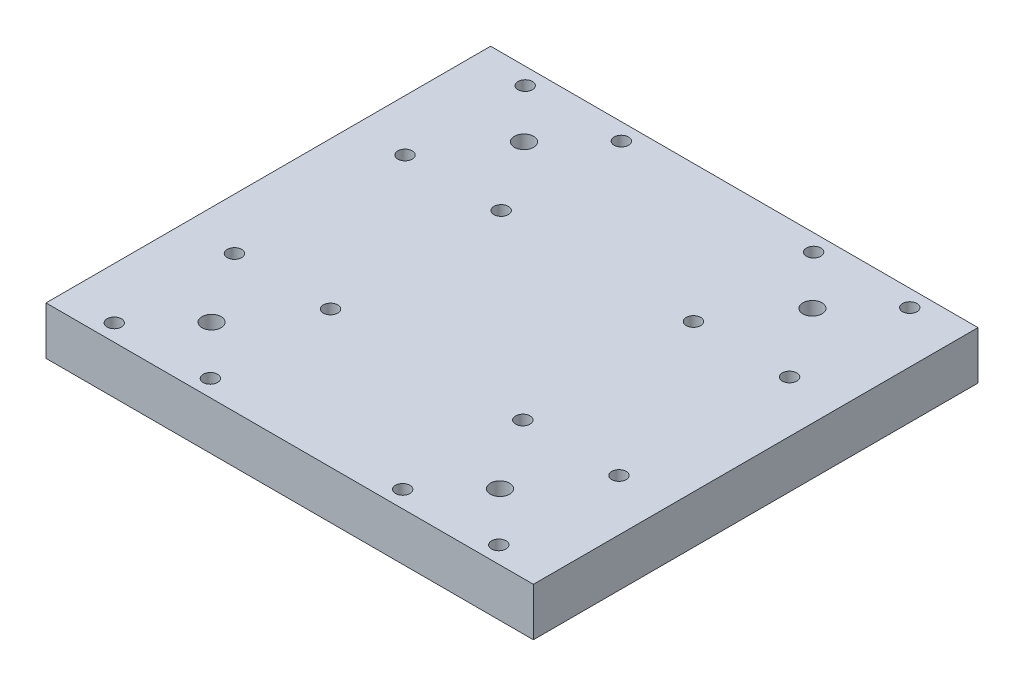
ISO-10303-21;
HEADER;
FILE_DESCRIPTION(('STEP AP214'),'2;1');
FILE_NAME('part.step','',(''),(''),'','','');
FILE_SCHEMA(('AUTOMOTIVE_DESIGN { 1 0 10303 214 1 1 1 1 }'));
ENDSEC;
DATA;
#1=APPLICATION_CONTEXT('core data for automotive mechanical design processes');
#2=APPLICATION_PROTOCOL_DEFINITION('international standard','automotive_design',2000,#1);
#3=PRODUCT_CONTEXT('',#1,'mechanical');
#4=PRODUCT('Part','Part','',(#3));
#5=PRODUCT_RELATED_PRODUCT_CATEGORY('part','',(#4));
#6=PRODUCT_DEFINITION_FORMATION('','',#4);
#7=PRODUCT_DEFINITION_CONTEXT('part definition',#1,'design');
#8=PRODUCT_DEFINITION('design','',#6,#7);
#9=PRODUCT_DEFINITION_SHAPE('','',#8);
#10=(LENGTH_UNIT() NAMED_UNIT(*) SI_UNIT(.MILLI.,.METRE.));
#11=(NAMED_UNIT(*) PLANE_ANGLE_UNIT() SI_UNIT($,.RADIAN.));
#12=(NAMED_UNIT(*) SI_UNIT($,.STERADIAN.) SOLID_ANGLE_UNIT());
#13=UNCERTAINTY_MEASURE_WITH_UNIT(LENGTH_MEASURE(1.E-05),#10,'distance_accuracy_value','');
#14=(GEOMETRIC_REPRESENTATION_CONTEXT(3) GLOBAL_UNCERTAINTY_ASSIGNED_CONTEXT((#13)) GLOBAL_UNIT_ASSIGNED_CONTEXT((#10,
#11,#12)) REPRESENTATION_CONTEXT('',''));
#15=CARTESIAN_POINT('',(0.,0.,0.));
#16=DIRECTION('',(0.,0.,1.));
#17=DIRECTION('',(1.,0.,0.));
#18=AXIS2_PLACEMENT_3D('',#15,#16,#17);
#19=CARTESIAN_POINT('',(0.,10.,0.));
#20=DIRECTION('',(0.,-1.,0.));
#21=DIRECTION('',(0.,0.,-1.));
#22=AXIS2_PLACEMENT_3D('',#19,#20,#21);
#23=PLANE('',#22);
#24=DIRECTION('',(0.,0.,-1.));
#25=VECTOR('',#24,1.);
#26=CARTESIAN_POINT('',(50.7,10.,46.25));
#27=LINE('',#26,#25);
#28=CARTESIAN_POINT('',(50.7,10.,46.25));
#29=VERTEX_POINT('',#28);
#30=CARTESIAN_POINT('',(50.7,10.,-46.25));
#31=VERTEX_POINT('',#30);
#32=EDGE_CURVE('E85',#29,#31,#27,.T.);
#33=ORIENTED_EDGE('',*,*,#32,.T.);
#34=DIRECTION('',(-1.,0.,0.));
#35=VECTOR('',#34,1.);
#36=CARTESIAN_POINT('',(-50.7,10.,-46.25));
#37=LINE('',#36,#35);
#38=CARTESIAN_POINT('',(-50.7,10.,-46.25));
#39=VERTEX_POINT('',#38);
#40=EDGE_CURVE('E80',#31,#39,#37,.T.);
#41=ORIENTED_EDGE('',*,*,#40,.T.);
#42=DIRECTION('',(0.,0.,1.));
#43=VECTOR('',#42,1.);
#44=CARTESIAN_POINT('',(-50.7,10.,46.25));
#45=LINE('',#44,#43);
#46=CARTESIAN_POINT('',(-50.7,10.,46.25));
#47=VERTEX_POINT('',#46);
#48=EDGE_CURVE('E83',#39,#47,#45,.T.);
#49=ORIENTED_EDGE('',*,*,#48,.T.);
#50=DIRECTION('',(1.,0.,0.));
#51=VECTOR('',#50,1.);
#52=CARTESIAN_POINT('',(-50.7,10.,46.25));
#53=LINE('',#52,#51);
#54=EDGE_CURVE('E50',#47,#29,#53,.T.);
#55=ORIENTED_EDGE('',*,*,#54,.T.);
#56=EDGE_LOOP('',(#33,#41,#49,#55));
#57=FACE_BOUND('',#56,.T.);
#58=CARTESIAN_POINT('',(-40.,10.,-42.75));
#59=DIRECTION('',(0.,1.,0.));
#60=DIRECTION('',(0.,0.,1.));
#61=AXIS2_PLACEMENT_3D('',#58,#59,#60);
#62=CIRCLE('',#61,1.5);
#63=CARTESIAN_POINT('',(-40.,10.,-41.25));
#64=VERTEX_POINT('',#63);
#65=EDGE_CURVE('E100',#64,#64,#62,.T.);
#66=ORIENTED_EDGE('',*,*,#65,.F.);
#67=EDGE_LOOP('',(#66));
#68=FACE_BOUND('',#67,.T.);
#69=CARTESIAN_POINT('',(-20.,10.,-42.75));
#70=DIRECTION('',(0.,1.,0.));
#71=DIRECTION('',(0.,0.,1.));
#72=AXIS2_PLACEMENT_3D('',#69,#70,#71);
#73=CIRCLE('',#72,1.5);
#74=CARTESIAN_POINT('',(-20.,10.,-41.25));
#75=VERTEX_POINT('',#74);
#76=EDGE_CURVE('E115',#75,#75,#73,.T.);
#77=ORIENTED_EDGE('',*,*,#76,.F.);
#78=EDGE_LOOP('',(#77));
#79=FACE_BOUND('',#78,.T.);
#80=CARTESIAN_POINT('',(-20.,10.,-17.75));
#81=DIRECTION('',(0.,1.,0.));
#82=DIRECTION('',(0.,0.,1.));
#83=AXIS2_PLACEMENT_3D('',#80,#81,#82);
#84=CIRCLE('',#83,1.5);
#85=CARTESIAN_POINT('',(-20.,10.,-16.25));
#86=VERTEX_POINT('',#85);
#87=EDGE_CURVE('E121',#86,#86,#84,.T.);
#88=ORIENTED_EDGE('',*,*,#87,.F.);
#89=EDGE_LOOP('',(#88));
#90=FACE_BOUND('',#89,.T.);
#91=CARTESIAN_POINT('',(-40.,10.,-17.75));
#92=DIRECTION('',(0.,1.,0.));
#93=DIRECTION('',(0.,0.,1.));
#94=AXIS2_PLACEMENT_3D('',#91,#92,#93);
#95=CIRCLE('',#94,1.5);
#96=CARTESIAN_POINT('',(-40.,10.,-16.25));
#97=VERTEX_POINT('',#96);
#98=EDGE_CURVE('E127',#97,#97,#95,.T.);
#99=ORIENTED_EDGE('',*,*,#98,.F.);
#100=EDGE_LOOP('',(#99));
#101=FACE_BOUND('',#100,.T.);
#102=CARTESIAN_POINT('',(-40.,10.,42.75));
#103=DIRECTION('',(0.,1.,0.));
#104=DIRECTION('',(0.,0.,-1.));
#105=AXIS2_PLACEMENT_3D('',#102,#103,#104);
#106=CIRCLE('',#105,1.5);
#107=CARTESIAN_POINT('',(-40.,10.,41.25));
#108=VERTEX_POINT('',#107);
#109=EDGE_CURVE('E133',#108,#108,#106,.T.);
#110=ORIENTED_EDGE('',*,*,#109,.F.);
#111=EDGE_LOOP('',(#110));
#112=FACE_BOUND('',#111,.T.);
#113=CARTESIAN_POINT('',(-20.,10.,42.75));
#114=DIRECTION('',(0.,1.,0.));
#115=DIRECTION('',(0.,0.,-1.));
#116=AXIS2_PLACEMENT_3D('',#113,#114,#115);
#117=CIRCLE('',#116,1.5);
#118=CARTESIAN_POINT('',(-20.,10.,41.25));
#119=VERTEX_POINT('',#118);
#120=EDGE_CURVE('E139',#119,#119,#117,.T.);
#121=ORIENTED_EDGE('',*,*,#120,.F.);
#122=EDGE_LOOP('',(#121));
#123=FACE_BOUND('',#122,.T.);
#124=CARTESIAN_POINT('',(-20.,10.,17.75));
#125=DIRECTION('',(0.,1.,0.));
#126=DIRECTION('',(0.,0.,-1.));
#127=AXIS2_PLACEMENT_3D('',#124,#125,#126);
#128=CIRCLE('',#127,1.5);
#129=CARTESIAN_POINT('',(-20.,10.,16.25));
#130=VERTEX_POINT('',#129);
#131=EDGE_CURVE('E145',#130,#130,#128,.T.);
#132=ORIENTED_EDGE('',*,*,#131,.F.);
#133=EDGE_LOOP('',(#132));
#134=FACE_BOUND('',#133,.T.);
#135=CARTESIAN_POINT('',(30.,10.,-32.5));
#136=DIRECTION('',(0.,1.,0.));
#137=DIRECTION('',(0.,0.,-1.));
#138=AXIS2_PLACEMENT_3D('',#135,#136,#137);
#139=CIRCLE('',#138,2.);
#140=CARTESIAN_POINT('',(30.,10.,-34.5));
#141=VERTEX_POINT('',#140);
#142=EDGE_CURVE('E151',#141,#141,#139,.T.);
#143=ORIENTED_EDGE('',*,*,#142,.F.);
#144=EDGE_LOOP('',(#143));
#145=FACE_BOUND('',#144,.T.);
#146=CARTESIAN_POINT('',(-40.,10.,17.75));
#147=DIRECTION('',(0.,1.,0.));
#148=DIRECTION('',(0.,0.,-1.));
#149=AXIS2_PLACEMENT_3D('',#146,#147,#148);
#150=CIRCLE('',#149,1.5);
#151=CARTESIAN_POINT('',(-40.,10.,16.25));
#152=VERTEX_POINT('',#151);
#153=EDGE_CURVE('E157',#152,#152,#150,.T.);
#154=ORIENTED_EDGE('',*,*,#153,.F.);
#155=EDGE_LOOP('',(#154));
#156=FACE_BOUND('',#155,.T.);
#157=CARTESIAN_POINT('',(40.,10.,17.75));
#158=DIRECTION('',(0.,1.,0.));
#159=DIRECTION('',(0.,0.,1.));
#160=AXIS2_PLACEMENT_3D('',#157,#158,#159);
#161=CIRCLE('',#160,1.5);
#162=CARTESIAN_POINT('',(40.,10.,19.25));
#163=VERTEX_POINT('',#162);
#164=EDGE_CURVE('E163',#163,#163,#161,.T.);
#165=ORIENTED_EDGE('',*,*,#164,.F.);
#166=EDGE_LOOP('',(#165));
#167=FACE_BOUND('',#166,.T.);
#168=CARTESIAN_POINT('',(20.,10.,17.75));
#169=DIRECTION('',(0.,1.,0.));
#170=DIRECTION('',(0.,0.,1.));
#171=AXIS2_PLACEMENT_3D('',#168,#169,#170);
#172=CIRCLE('',#171,1.5);
#173=CARTESIAN_POINT('',(20.,10.,19.25));
#174=VERTEX_POINT('',#173);
#175=EDGE_CURVE('E169',#174,#174,#172,.T.);
#176=ORIENTED_EDGE('',*,*,#175,.F.);
#177=EDGE_LOOP('',(#176));
#178=FACE_BOUND('',#177,.T.);
#179=CARTESIAN_POINT('',(20.,10.,42.75));
#180=DIRECTION('',(0.,1.,0.));
#181=DIRECTION('',(0.,0.,1.));
#182=AXIS2_PLACEMENT_3D('',#179,#180,#181);
#183=CIRCLE('',#182,1.5);
#184=CARTESIAN_POINT('',(20.,10.,44.25));
#185=VERTEX_POINT('',#184);
#186=EDGE_CURVE('E175',#185,#185,#183,.T.);
#187=ORIENTED_EDGE('',*,*,#186,.F.);
#188=EDGE_LOOP('',(#187));
#189=FACE_BOUND('',#188,.T.);
#190=CARTESIAN_POINT('',(40.,10.,42.75));
#191=DIRECTION('',(0.,1.,0.));
#192=DIRECTION('',(0.,0.,1.));
#193=AXIS2_PLACEMENT_3D('',#190,#191,#192);
#194=CIRCLE('',#193,1.5);
#195=CARTESIAN_POINT('',(40.,10.,44.25));
#196=VERTEX_POINT('',#195);
#197=EDGE_CURVE('E181',#196,#196,#194,.T.);
#198=ORIENTED_EDGE('',*,*,#197,.F.);
#199=EDGE_LOOP('',(#198));
#200=FACE_BOUND('',#199,.T.);
#201=CARTESIAN_POINT('',(40.,10.,-17.75));
#202=DIRECTION('',(0.,1.,0.));
#203=DIRECTION('',(0.,0.,-1.));
#204=AXIS2_PLACEMENT_3D('',#201,#202,#203);
#205=CIRCLE('',#204,1.5);
#206=CARTESIAN_POINT('',(40.,10.,-19.25));
#207=VERTEX_POINT('',#206);
#208=EDGE_CURVE('E187',#207,#207,#205,.T.);
#209=ORIENTED_EDGE('',*,*,#208,.F.);
#210=EDGE_LOOP('',(#209));
#211=FACE_BOUND('',#210,.T.);
#212=CARTESIAN_POINT('',(20.,10.,-17.75));
#213=DIRECTION('',(0.,1.,0.));
#214=DIRECTION('',(0.,0.,-1.));
#215=AXIS2_PLACEMENT_3D('',#212,#213,#214);
#216=CIRCLE('',#215,1.5);
#217=CARTESIAN_POINT('',(20.,10.,-19.25));
#218=VERTEX_POINT('',#217);
#219=EDGE_CURVE('E193',#218,#218,#216,.T.);
#220=ORIENTED_EDGE('',*,*,#219,.F.);
#221=EDGE_LOOP('',(#220));
#222=FACE_BOUND('',#221,.T.);
#223=CARTESIAN_POINT('',(20.,10.,-42.75));
#224=DIRECTION('',(0.,1.,0.));
#225=DIRECTION('',(0.,0.,-1.));
#226=AXIS2_PLACEMENT_3D('',#223,#224,#225);
#227=CIRCLE('',#226,1.5);
#228=CARTESIAN_POINT('',(20.,10.,-44.25));
#229=VERTEX_POINT('',#228);
#230=EDGE_CURVE('E199',#229,#229,#227,.T.);
#231=ORIENTED_EDGE('',*,*,#230,.F.);
#232=EDGE_LOOP('',(#231));
#233=FACE_BOUND('',#232,.T.);
#234=CARTESIAN_POINT('',(40.,10.,-42.75));
#235=DIRECTION('',(0.,1.,0.));
#236=DIRECTION('',(0.,0.,-1.));
#237=AXIS2_PLACEMENT_3D('',#234,#235,#236);
#238=CIRCLE('',#237,1.5);
#239=CARTESIAN_POINT('',(40.,10.,-44.25));
#240=VERTEX_POINT('',#239);
#241=EDGE_CURVE('E205',#240,#240,#238,.T.);
#242=ORIENTED_EDGE('',*,*,#241,.F.);
#243=EDGE_LOOP('',(#242));
#244=FACE_BOUND('',#243,.T.);
#245=CARTESIAN_POINT('',(-30.,10.,-32.5));
#246=DIRECTION('',(0.,1.,0.));
#247=DIRECTION('',(0.,0.,1.));
#248=AXIS2_PLACEMENT_3D('',#245,#246,#247);
#249=CIRCLE('',#248,2.);
#250=CARTESIAN_POINT('',(-30.,10.,-30.5));
#251=VERTEX_POINT('',#250);
#252=EDGE_CURVE('E211',#251,#251,#249,.T.);
#253=ORIENTED_EDGE('',*,*,#252,.F.);
#254=EDGE_LOOP('',(#253));
#255=FACE_BOUND('',#254,.T.);
#256=CARTESIAN_POINT('',(30.,10.,32.5));
#257=DIRECTION('',(0.,1.,0.));
#258=DIRECTION('',(0.,0.,1.));
#259=AXIS2_PLACEMENT_3D('',#256,#257,#258);
#260=CIRCLE('',#259,2.);
#261=CARTESIAN_POINT('',(30.,10.,34.5));
#262=VERTEX_POINT('',#261);
#263=EDGE_CURVE('E217',#262,#262,#260,.T.);
#264=ORIENTED_EDGE('',*,*,#263,.F.);
#265=EDGE_LOOP('',(#264));
#266=FACE_BOUND('',#265,.T.);
#267=CARTESIAN_POINT('',(-30.,10.,32.5));
#268=DIRECTION('',(0.,1.,0.));
#269=DIRECTION('',(0.,0.,-1.));
#270=AXIS2_PLACEMENT_3D('',#267,#268,#269);
#271=CIRCLE('',#270,2.);
#272=CARTESIAN_POINT('',(-30.,10.,30.5));
#273=VERTEX_POINT('',#272);
#274=EDGE_CURVE('E223',#273,#273,#271,.T.);
#275=ORIENTED_EDGE('',*,*,#274,.F.);
#276=EDGE_LOOP('',(#275));
#277=FACE_BOUND('',#276,.T.);
#278=ADVANCED_FACE('F33',(#57,#68,#79,#90,#101,#112,#123,#134,#145,#156,#167,#178,#189,#200,
#211,#222,#233,#244,#255,#266,#277),#23,.F.);
#279=CARTESIAN_POINT('',(0.,0.,0.));
#280=DIRECTION('',(0.,-1.,0.));
#281=DIRECTION('',(0.,0.,-1.));
#282=AXIS2_PLACEMENT_3D('',#279,#280,#281);
#283=PLANE('',#282);
#284=CARTESIAN_POINT('',(30.,0.,32.5));
#285=DIRECTION('',(0.,1.,0.));
#286=DIRECTION('',(0.,0.,1.));
#287=AXIS2_PLACEMENT_3D('',#284,#285,#286);
#288=CIRCLE('',#287,2.);
#289=CARTESIAN_POINT('',(30.,0.,34.5));
#290=VERTEX_POINT('',#289);
#291=EDGE_CURVE('E220',#290,#290,#288,.T.);
#292=ORIENTED_EDGE('',*,*,#291,.T.);
#293=EDGE_LOOP('',(#292));
#294=FACE_BOUND('',#293,.T.);
#295=CARTESIAN_POINT('',(40.,0.,-42.75));
#296=DIRECTION('',(0.,1.,0.));
#297=DIRECTION('',(0.,0.,-1.));
#298=AXIS2_PLACEMENT_3D('',#295,#296,#297);
#299=CIRCLE('',#298,1.5);
#300=CARTESIAN_POINT('',(40.,0.,-44.25));
#301=VERTEX_POINT('',#300);
#302=EDGE_CURVE('E208',#301,#301,#299,.T.);
#303=ORIENTED_EDGE('',*,*,#302,.T.);
#304=EDGE_LOOP('',(#303));
#305=FACE_BOUND('',#304,.T.);
#306=CARTESIAN_POINT('',(20.,0.,-17.75));
#307=DIRECTION('',(0.,1.,0.));
#308=DIRECTION('',(0.,0.,-1.));
#309=AXIS2_PLACEMENT_3D('',#306,#307,#308);
#310=CIRCLE('',#309,1.5);
#311=CARTESIAN_POINT('',(20.,0.,-19.25));
#312=VERTEX_POINT('',#311);
#313=EDGE_CURVE('E196',#312,#312,#310,.T.);
#314=ORIENTED_EDGE('',*,*,#313,.T.);
#315=EDGE_LOOP('',(#314));
#316=FACE_BOUND('',#315,.T.);
#317=CARTESIAN_POINT('',(40.,0.,42.75));
#318=DIRECTION('',(0.,1.,0.));
#319=DIRECTION('',(0.,0.,1.));
#320=AXIS2_PLACEMENT_3D('',#317,#318,#319);
#321=CIRCLE('',#320,1.5);
#322=CARTESIAN_POINT('',(40.,0.,44.25));
#323=VERTEX_POINT('',#322);
#324=EDGE_CURVE('E184',#323,#323,#321,.T.);
#325=ORIENTED_EDGE('',*,*,#324,.T.);
#326=EDGE_LOOP('',(#325));
#327=FACE_BOUND('',#326,.T.);
#328=CARTESIAN_POINT('',(20.,0.,17.75));
#329=DIRECTION('',(0.,1.,0.));
#330=DIRECTION('',(0.,0.,1.));
#331=AXIS2_PLACEMENT_3D('',#328,#329,#330);
#332=CIRCLE('',#331,1.5);
#333=CARTESIAN_POINT('',(20.,0.,19.25));
#334=VERTEX_POINT('',#333);
#335=EDGE_CURVE('E172',#334,#334,#332,.T.);
#336=ORIENTED_EDGE('',*,*,#335,.T.);
#337=EDGE_LOOP('',(#336));
#338=FACE_BOUND('',#337,.T.);
#339=CARTESIAN_POINT('',(-40.,0.,17.75));
#340=DIRECTION('',(0.,1.,0.));
#341=DIRECTION('',(0.,0.,-1.));
#342=AXIS2_PLACEMENT_3D('',#339,#340,#341);
#343=CIRCLE('',#342,1.5);
#344=CARTESIAN_POINT('',(-40.,0.,16.25));
#345=VERTEX_POINT('',#344);
#346=EDGE_CURVE('E160',#345,#345,#343,.T.);
#347=ORIENTED_EDGE('',*,*,#346,.T.);
#348=EDGE_LOOP('',(#347));
#349=FACE_BOUND('',#348,.T.);
#350=CARTESIAN_POINT('',(-20.,0.,17.75));
#351=DIRECTION('',(0.,1.,0.));
#352=DIRECTION('',(0.,0.,-1.));
#353=AXIS2_PLACEMENT_3D('',#350,#351,#352);
#354=CIRCLE('',#353,1.5);
#355=CARTESIAN_POINT('',(-20.,0.,16.25));
#356=VERTEX_POINT('',#355);
#357=EDGE_CURVE('E148',#356,#356,#354,.T.);
#358=ORIENTED_EDGE('',*,*,#357,.T.);
#359=EDGE_LOOP('',(#358));
#360=FACE_BOUND('',#359,.T.);
#361=CARTESIAN_POINT('',(-40.,0.,42.75));
#362=DIRECTION('',(0.,1.,0.));
#363=DIRECTION('',(0.,0.,-1.));
#364=AXIS2_PLACEMENT_3D('',#361,#362,#363);
#365=CIRCLE('',#364,1.5);
#366=CARTESIAN_POINT('',(-40.,0.,41.25));
#367=VERTEX_POINT('',#366);
#368=EDGE_CURVE('E136',#367,#367,#365,.T.);
#369=ORIENTED_EDGE('',*,*,#368,.T.);
#370=EDGE_LOOP('',(#369));
#371=FACE_BOUND('',#370,.T.);
#372=CARTESIAN_POINT('',(-20.,0.,-17.75));
#373=DIRECTION('',(0.,1.,0.));
#374=DIRECTION('',(0.,0.,1.));
#375=AXIS2_PLACEMENT_3D('',#372,#373,#374);
#376=CIRCLE('',#375,1.5);
#377=CARTESIAN_POINT('',(-20.,0.,-16.25));
#378=VERTEX_POINT('',#377);
#379=EDGE_CURVE('E124',#378,#378,#376,.T.);
#380=ORIENTED_EDGE('',*,*,#379,.T.);
#381=EDGE_LOOP('',(#380));
#382=FACE_BOUND('',#381,.T.);
#383=CARTESIAN_POINT('',(-40.,0.,-42.75));
#384=DIRECTION('',(0.,1.,0.));
#385=DIRECTION('',(0.,0.,1.));
#386=AXIS2_PLACEMENT_3D('',#383,#384,#385);
#387=CIRCLE('',#386,1.5);
#388=CARTESIAN_POINT('',(-40.,0.,-41.25));
#389=VERTEX_POINT('',#388);
#390=EDGE_CURVE('E112',#389,#389,#387,.T.);
#391=ORIENTED_EDGE('',*,*,#390,.T.);
#392=EDGE_LOOP('',(#391));
#393=FACE_BOUND('',#392,.T.);
#394=DIRECTION('',(0.,0.,-1.));
#395=VECTOR('',#394,1.);
#396=CARTESIAN_POINT('',(50.7,0.,46.25));
#397=LINE('',#396,#395);
#398=CARTESIAN_POINT('',(50.7,0.,46.25));
#399=VERTEX_POINT('',#398);
#400=CARTESIAN_POINT('',(50.7,0.,-46.25));
#401=VERTEX_POINT('',#400);
#402=EDGE_CURVE('E97',#399,#401,#397,.T.);
#403=ORIENTED_EDGE('',*,*,#402,.F.);
#404=DIRECTION('',(1.,0.,0.));
#405=VECTOR('',#404,1.);
#406=CARTESIAN_POINT('',(-50.7,0.,46.25));
#407=LINE('',#406,#405);
#408=CARTESIAN_POINT('',(-50.7,0.,46.25));
#409=VERTEX_POINT('',#408);
#410=EDGE_CURVE('E73',#409,#399,#407,.T.);
#411=ORIENTED_EDGE('',*,*,#410,.F.);
#412=DIRECTION('',(0.,0.,1.));
#413=VECTOR('',#412,1.);
#414=CARTESIAN_POINT('',(-50.7,0.,46.25));
#415=LINE('',#414,#413);
#416=CARTESIAN_POINT('',(-50.7,0.,-46.25));
#417=VERTEX_POINT('',#416);
#418=EDGE_CURVE('E67',#417,#409,#415,.T.);
#419=ORIENTED_EDGE('',*,*,#418,.F.);
#420=DIRECTION('',(-1.,0.,0.));
#421=VECTOR('',#420,1.);
#422=CARTESIAN_POINT('',(-50.7,0.,-46.25));
#423=LINE('',#422,#421);
#424=EDGE_CURVE('E89',#401,#417,#423,.T.);
#425=ORIENTED_EDGE('',*,*,#424,.F.);
#426=EDGE_LOOP('',(#403,#411,#419,#425));
#427=FACE_BOUND('',#426,.T.);
#428=CARTESIAN_POINT('',(-20.,0.,-42.75));
#429=DIRECTION('',(0.,1.,0.));
#430=DIRECTION('',(0.,0.,1.));
#431=AXIS2_PLACEMENT_3D('',#428,#429,#430);
#432=CIRCLE('',#431,1.5);
#433=CARTESIAN_POINT('',(-20.,0.,-41.25));
#434=VERTEX_POINT('',#433);
#435=EDGE_CURVE('E118',#434,#434,#432,.T.);
#436=ORIENTED_EDGE('',*,*,#435,.T.);
#437=EDGE_LOOP('',(#436));
#438=FACE_BOUND('',#437,.T.);
#439=CARTESIAN_POINT('',(-40.,0.,-17.75));
#440=DIRECTION('',(0.,1.,0.));
#441=DIRECTION('',(0.,0.,1.));
#442=AXIS2_PLACEMENT_3D('',#439,#440,#441);
#443=CIRCLE('',#442,1.5);
#444=CARTESIAN_POINT('',(-40.,0.,-16.25));
#445=VERTEX_POINT('',#444);
#446=EDGE_CURVE('E130',#445,#445,#443,.T.);
#447=ORIENTED_EDGE('',*,*,#446,.T.);
#448=EDGE_LOOP('',(#447));
#449=FACE_BOUND('',#448,.T.);
#450=CARTESIAN_POINT('',(-20.,0.,42.75));
#451=DIRECTION('',(0.,1.,0.));
#452=DIRECTION('',(0.,0.,-1.));
#453=AXIS2_PLACEMENT_3D('',#450,#451,#452);
#454=CIRCLE('',#453,1.5);
#455=CARTESIAN_POINT('',(-20.,0.,41.25));
#456=VERTEX_POINT('',#455);
#457=EDGE_CURVE('E142',#456,#456,#454,.T.);
#458=ORIENTED_EDGE('',*,*,#457,.T.);
#459=EDGE_LOOP('',(#458));
#460=FACE_BOUND('',#459,.T.);
#461=CARTESIAN_POINT('',(30.,0.,-32.5));
#462=DIRECTION('',(0.,1.,0.));
#463=DIRECTION('',(0.,0.,-1.));
#464=AXIS2_PLACEMENT_3D('',#461,#462,#463);
#465=CIRCLE('',#464,2.);
#466=CARTESIAN_POINT('',(30.,0.,-34.5));
#467=VERTEX_POINT('',#466);
#468=EDGE_CURVE('E154',#467,#467,#465,.T.);
#469=ORIENTED_EDGE('',*,*,#468,.T.);
#470=EDGE_LOOP('',(#469));
#471=FACE_BOUND('',#470,.T.);
#472=CARTESIAN_POINT('',(40.,0.,17.75));
#473=DIRECTION('',(0.,1.,0.));
#474=DIRECTION('',(0.,0.,1.));
#475=AXIS2_PLACEMENT_3D('',#472,#473,#474);
#476=CIRCLE('',#475,1.5);
#477=CARTESIAN_POINT('',(40.,0.,19.25));
#478=VERTEX_POINT('',#477);
#479=EDGE_CURVE('E166',#478,#478,#476,.T.);
#480=ORIENTED_EDGE('',*,*,#479,.T.);
#481=EDGE_LOOP('',(#480));
#482=FACE_BOUND('',#481,.T.);
#483=CARTESIAN_POINT('',(20.,0.,42.75));
#484=DIRECTION('',(0.,1.,0.));
#485=DIRECTION('',(0.,0.,1.));
#486=AXIS2_PLACEMENT_3D('',#483,#484,#485);
#487=CIRCLE('',#486,1.5);
#488=CARTESIAN_POINT('',(20.,0.,44.25));
#489=VERTEX_POINT('',#488);
#490=EDGE_CURVE('E178',#489,#489,#487,.T.);
#491=ORIENTED_EDGE('',*,*,#490,.T.);
#492=EDGE_LOOP('',(#491));
#493=FACE_BOUND('',#492,.T.);
#494=CARTESIAN_POINT('',(40.,0.,-17.75));
#495=DIRECTION('',(0.,1.,0.));
#496=DIRECTION('',(0.,0.,-1.));
#497=AXIS2_PLACEMENT_3D('',#494,#495,#496);
#498=CIRCLE('',#497,1.5);
#499=CARTESIAN_POINT('',(40.,0.,-19.25));
#500=VERTEX_POINT('',#499);
#501=EDGE_CURVE('E190',#500,#500,#498,.T.);
#502=ORIENTED_EDGE('',*,*,#501,.T.);
#503=EDGE_LOOP('',(#502));
#504=FACE_BOUND('',#503,.T.);
#505=CARTESIAN_POINT('',(20.,0.,-42.75));
#506=DIRECTION('',(0.,1.,0.));
#507=DIRECTION('',(0.,0.,-1.));
#508=AXIS2_PLACEMENT_3D('',#505,#506,#507);
#509=CIRCLE('',#508,1.5);
#510=CARTESIAN_POINT('',(20.,0.,-44.25));
#511=VERTEX_POINT('',#510);
#512=EDGE_CURVE('E202',#511,#511,#509,.T.);
#513=ORIENTED_EDGE('',*,*,#512,.T.);
#514=EDGE_LOOP('',(#513));
#515=FACE_BOUND('',#514,.T.);
#516=CARTESIAN_POINT('',(-30.,0.,-32.5));
#517=DIRECTION('',(0.,1.,0.));
#518=DIRECTION('',(0.,0.,1.));
#519=AXIS2_PLACEMENT_3D('',#516,#517,#518);
#520=CIRCLE('',#519,2.);
#521=CARTESIAN_POINT('',(-30.,0.,-30.5));
#522=VERTEX_POINT('',#521);
#523=EDGE_CURVE('E214',#522,#522,#520,.T.);
#524=ORIENTED_EDGE('',*,*,#523,.T.);
#525=EDGE_LOOP('',(#524));
#526=FACE_BOUND('',#525,.T.);
#527=CARTESIAN_POINT('',(-30.,0.,32.5));
#528=DIRECTION('',(0.,1.,0.));
#529=DIRECTION('',(0.,0.,-1.));
#530=AXIS2_PLACEMENT_3D('',#527,#528,#529);
#531=CIRCLE('',#530,2.);
#532=CARTESIAN_POINT('',(-30.,0.,30.5));
#533=VERTEX_POINT('',#532);
#534=EDGE_CURVE('E226',#533,#533,#531,.T.);
#535=ORIENTED_EDGE('',*,*,#534,.T.);
#536=EDGE_LOOP('',(#535));
#537=FACE_BOUND('',#536,.T.);
#538=ADVANCED_FACE('F108',(#294,#305,#316,#327,#338,#349,#360,#371,#382,#393,#427,#438,#449,
#460,#471,#482,#493,#504,#515,#526,#537),#283,.T.);
#539=CARTESIAN_POINT('',(50.7,10.,46.25));
#540=DIRECTION('',(-1.,0.,0.));
#541=DIRECTION('',(0.,0.,1.));
#542=AXIS2_PLACEMENT_3D('',#539,#540,#541);
#543=PLANE('',#542);
#544=ORIENTED_EDGE('',*,*,#402,.T.);
#545=DIRECTION('',(0.,-1.,0.));
#546=VECTOR('',#545,1.);
#547=CARTESIAN_POINT('',(50.7,10.,-46.25));
#548=LINE('',#547,#546);
#549=EDGE_CURVE('E11',#31,#401,#548,.T.);
#550=ORIENTED_EDGE('',*,*,#549,.F.);
#551=ORIENTED_EDGE('',*,*,#32,.F.);
#552=DIRECTION('',(0.,-1.,0.));
#553=VECTOR('',#552,1.);
#554=CARTESIAN_POINT('',(50.7,10.,46.25));
#555=LINE('',#554,#553);
#556=EDGE_CURVE('E93',#29,#399,#555,.T.);
#557=ORIENTED_EDGE('',*,*,#556,.T.);
#558=EDGE_LOOP('',(#544,#550,#551,#557));
#559=FACE_BOUND('',#558,.T.);
#560=ADVANCED_FACE('F35',(#559),#543,.F.);
#561=CARTESIAN_POINT('',(-50.7,10.,-46.25));
#562=DIRECTION('',(0.,0.,1.));
#563=DIRECTION('',(1.,0.,0.));
#564=AXIS2_PLACEMENT_3D('',#561,#562,#563);
#565=PLANE('',#564);
#566=ORIENTED_EDGE('',*,*,#424,.T.);
#567=DIRECTION('',(0.,-1.,0.));
#568=VECTOR('',#567,1.);
#569=CARTESIAN_POINT('',(-50.7,10.,-46.25));
#570=LINE('',#569,#568);
#571=EDGE_CURVE('E42',#39,#417,#570,.T.);
#572=ORIENTED_EDGE('',*,*,#571,.F.);
#573=ORIENTED_EDGE('',*,*,#40,.F.);
#574=ORIENTED_EDGE('',*,*,#549,.T.);
#575=EDGE_LOOP('',(#566,#572,#573,#574));
#576=FACE_BOUND('',#575,.T.);
#577=ADVANCED_FACE('F88',(#576),#565,.F.);
#578=CARTESIAN_POINT('',(-50.7,10.,46.25));
#579=DIRECTION('',(1.,0.,0.));
#580=DIRECTION('',(0.,0.,-1.));
#581=AXIS2_PLACEMENT_3D('',#578,#579,#580);
#582=PLANE('',#581);
#583=ORIENTED_EDGE('',*,*,#418,.T.);
#584=DIRECTION('',(0.,-1.,0.));
#585=VECTOR('',#584,1.);
#586=CARTESIAN_POINT('',(-50.7,10.,46.25));
#587=LINE('',#586,#585);
#588=EDGE_CURVE('E90',#47,#409,#587,.T.);
#589=ORIENTED_EDGE('',*,*,#588,.F.);
#590=ORIENTED_EDGE('',*,*,#48,.F.);
#591=ORIENTED_EDGE('',*,*,#571,.T.);
#592=EDGE_LOOP('',(#583,#589,#590,#591));
#593=FACE_BOUND('',#592,.T.);
#594=ADVANCED_FACE('F91',(#593),#582,.F.);
#595=CARTESIAN_POINT('',(-50.7,10.,46.25));
#596=DIRECTION('',(0.,0.,-1.));
#597=DIRECTION('',(-1.,0.,0.));
#598=AXIS2_PLACEMENT_3D('',#595,#596,#597);
#599=PLANE('',#598);
#600=ORIENTED_EDGE('',*,*,#410,.T.);
#601=ORIENTED_EDGE('',*,*,#556,.F.);
#602=ORIENTED_EDGE('',*,*,#54,.F.);
#603=ORIENTED_EDGE('',*,*,#588,.T.);
#604=EDGE_LOOP('',(#600,#601,#602,#603));
#605=FACE_BOUND('',#604,.T.);
#606=ADVANCED_FACE('F105',(#605),#599,.F.);
#607=CARTESIAN_POINT('',(-40.,10.,-42.75));
#608=DIRECTION('',(0.,-1.,0.));
#609=DIRECTION('',(0.,0.,-1.));
#610=AXIS2_PLACEMENT_3D('',#607,#608,#609);
#611=CYLINDRICAL_SURFACE('',#610,1.5);
#612=ORIENTED_EDGE('',*,*,#65,.T.);
#613=EDGE_LOOP('',(#612));
#614=FACE_BOUND('',#613,.T.);
#615=ORIENTED_EDGE('',*,*,#390,.F.);
#616=EDGE_LOOP('',(#615));
#617=FACE_BOUND('',#616,.T.);
#618=ADVANCED_FACE('F243',(#614,#617),#611,.F.);
#619=CARTESIAN_POINT('',(-20.,10.,-42.75));
#620=DIRECTION('',(0.,-1.,0.));
#621=DIRECTION('',(0.,0.,-1.));
#622=AXIS2_PLACEMENT_3D('',#619,#620,#621);
#623=CYLINDRICAL_SURFACE('',#622,1.5);
#624=ORIENTED_EDGE('',*,*,#76,.T.);
#625=EDGE_LOOP('',(#624));
#626=FACE_BOUND('',#625,.T.);
#627=ORIENTED_EDGE('',*,*,#435,.F.);
#628=EDGE_LOOP('',(#627));
#629=FACE_BOUND('',#628,.T.);
#630=ADVANCED_FACE('F289',(#626,#629),#623,.F.);
#631=CARTESIAN_POINT('',(-20.,10.,-17.75));
#632=DIRECTION('',(0.,-1.,0.));
#633=DIRECTION('',(0.,0.,-1.));
#634=AXIS2_PLACEMENT_3D('',#631,#632,#633);
#635=CYLINDRICAL_SURFACE('',#634,1.5);
#636=ORIENTED_EDGE('',*,*,#87,.T.);
#637=EDGE_LOOP('',(#636));
#638=FACE_BOUND('',#637,.T.);
#639=ORIENTED_EDGE('',*,*,#379,.F.);
#640=EDGE_LOOP('',(#639));
#641=FACE_BOUND('',#640,.T.);
#642=ADVANCED_FACE('F297',(#638,#641),#635,.F.);
#643=CARTESIAN_POINT('',(-40.,10.,-17.75));
#644=DIRECTION('',(0.,-1.,0.));
#645=DIRECTION('',(0.,0.,-1.));
#646=AXIS2_PLACEMENT_3D('',#643,#644,#645);
#647=CYLINDRICAL_SURFACE('',#646,1.5);
#648=ORIENTED_EDGE('',*,*,#98,.T.);
#649=EDGE_LOOP('',(#648));
#650=FACE_BOUND('',#649,.T.);
#651=ORIENTED_EDGE('',*,*,#446,.F.);
#652=EDGE_LOOP('',(#651));
#653=FACE_BOUND('',#652,.T.);
#654=ADVANCED_FACE('F305',(#650,#653),#647,.F.);
#655=CARTESIAN_POINT('',(-40.,10.,42.75));
#656=DIRECTION('',(0.,-1.,0.));
#657=DIRECTION('',(0.,0.,-1.));
#658=AXIS2_PLACEMENT_3D('',#655,#656,#657);
#659=CYLINDRICAL_SURFACE('',#658,1.5);
#660=ORIENTED_EDGE('',*,*,#109,.T.);
#661=EDGE_LOOP('',(#660));
#662=FACE_BOUND('',#661,.T.);
#663=ORIENTED_EDGE('',*,*,#368,.F.);
#664=EDGE_LOOP('',(#663));
#665=FACE_BOUND('',#664,.T.);
#666=ADVANCED_FACE('F314',(#662,#665),#659,.F.);
#667=CARTESIAN_POINT('',(-20.,10.,42.75));
#668=DIRECTION('',(0.,-1.,0.));
#669=DIRECTION('',(0.,0.,-1.));
#670=AXIS2_PLACEMENT_3D('',#667,#668,#669);
#671=CYLINDRICAL_SURFACE('',#670,1.5);
#672=ORIENTED_EDGE('',*,*,#120,.T.);
#673=EDGE_LOOP('',(#672));
#674=FACE_BOUND('',#673,.T.);
#675=ORIENTED_EDGE('',*,*,#457,.F.);
#676=EDGE_LOOP('',(#675));
#677=FACE_BOUND('',#676,.T.);
#678=ADVANCED_FACE('F323',(#674,#677),#671,.F.);
#679=CARTESIAN_POINT('',(-20.,10.,17.75));
#680=DIRECTION('',(0.,-1.,0.));
#681=DIRECTION('',(0.,0.,-1.));
#682=AXIS2_PLACEMENT_3D('',#679,#680,#681);
#683=CYLINDRICAL_SURFACE('',#682,1.5);
#684=ORIENTED_EDGE('',*,*,#131,.T.);
#685=EDGE_LOOP('',(#684));
#686=FACE_BOUND('',#685,.T.);
#687=ORIENTED_EDGE('',*,*,#357,.F.);
#688=EDGE_LOOP('',(#687));
#689=FACE_BOUND('',#688,.T.);
#690=ADVANCED_FACE('F332',(#686,#689),#683,.F.);
#691=CARTESIAN_POINT('',(30.,10.,-32.5));
#692=DIRECTION('',(0.,-1.,0.));
#693=DIRECTION('',(0.,0.,-1.));
#694=AXIS2_PLACEMENT_3D('',#691,#692,#693);
#695=CYLINDRICAL_SURFACE('',#694,2.);
#696=ORIENTED_EDGE('',*,*,#142,.T.);
#697=EDGE_LOOP('',(#696));
#698=FACE_BOUND('',#697,.T.);
#699=ORIENTED_EDGE('',*,*,#468,.F.);
#700=EDGE_LOOP('',(#699));
#701=FACE_BOUND('',#700,.T.);
#702=ADVANCED_FACE('F341',(#698,#701),#695,.F.);
#703=CARTESIAN_POINT('',(-40.,10.,17.75));
#704=DIRECTION('',(0.,-1.,0.));
#705=DIRECTION('',(0.,0.,-1.));
#706=AXIS2_PLACEMENT_3D('',#703,#704,#705);
#707=CYLINDRICAL_SURFACE('',#706,1.5);
#708=ORIENTED_EDGE('',*,*,#153,.T.);
#709=EDGE_LOOP('',(#708));
#710=FACE_BOUND('',#709,.T.);
#711=ORIENTED_EDGE('',*,*,#346,.F.);
#712=EDGE_LOOP('',(#711));
#713=FACE_BOUND('',#712,.T.);
#714=ADVANCED_FACE('F350',(#710,#713),#707,.F.);
#715=CARTESIAN_POINT('',(40.,10.,17.75));
#716=DIRECTION('',(0.,-1.,0.));
#717=DIRECTION('',(0.,0.,-1.));
#718=AXIS2_PLACEMENT_3D('',#715,#716,#717);
#719=CYLINDRICAL_SURFACE('',#718,1.5);
#720=ORIENTED_EDGE('',*,*,#164,.T.);
#721=EDGE_LOOP('',(#720));
#722=FACE_BOUND('',#721,.T.);
#723=ORIENTED_EDGE('',*,*,#479,.F.);
#724=EDGE_LOOP('',(#723));
#725=FACE_BOUND('',#724,.T.);
#726=ADVANCED_FACE('F359',(#722,#725),#719,.F.);
#727=CARTESIAN_POINT('',(20.,10.,17.75));
#728=DIRECTION('',(0.,-1.,0.));
#729=DIRECTION('',(0.,0.,-1.));
#730=AXIS2_PLACEMENT_3D('',#727,#728,#729);
#731=CYLINDRICAL_SURFACE('',#730,1.5);
#732=ORIENTED_EDGE('',*,*,#175,.T.);
#733=EDGE_LOOP('',(#732));
#734=FACE_BOUND('',#733,.T.);
#735=ORIENTED_EDGE('',*,*,#335,.F.);
#736=EDGE_LOOP('',(#735));
#737=FACE_BOUND('',#736,.T.);
#738=ADVANCED_FACE('F368',(#734,#737),#731,.F.);
#739=CARTESIAN_POINT('',(20.,10.,42.75));
#740=DIRECTION('',(0.,-1.,0.));
#741=DIRECTION('',(0.,0.,-1.));
#742=AXIS2_PLACEMENT_3D('',#739,#740,#741);
#743=CYLINDRICAL_SURFACE('',#742,1.5);
#744=ORIENTED_EDGE('',*,*,#186,.T.);
#745=EDGE_LOOP('',(#744));
#746=FACE_BOUND('',#745,.T.);
#747=ORIENTED_EDGE('',*,*,#490,.F.);
#748=EDGE_LOOP('',(#747));
#749=FACE_BOUND('',#748,.T.);
#750=ADVANCED_FACE('F377',(#746,#749),#743,.F.);
#751=CARTESIAN_POINT('',(40.,10.,42.75));
#752=DIRECTION('',(0.,-1.,0.));
#753=DIRECTION('',(0.,0.,-1.));
#754=AXIS2_PLACEMENT_3D('',#751,#752,#753);
#755=CYLINDRICAL_SURFACE('',#754,1.5);
#756=ORIENTED_EDGE('',*,*,#197,.T.);
#757=EDGE_LOOP('',(#756));
#758=FACE_BOUND('',#757,.T.);
#759=ORIENTED_EDGE('',*,*,#324,.F.);
#760=EDGE_LOOP('',(#759));
#761=FACE_BOUND('',#760,.T.);
#762=ADVANCED_FACE('F386',(#758,#761),#755,.F.);
#763=CARTESIAN_POINT('',(40.,10.,-17.75));
#764=DIRECTION('',(0.,-1.,0.));
#765=DIRECTION('',(0.,0.,-1.));
#766=AXIS2_PLACEMENT_3D('',#763,#764,#765);
#767=CYLINDRICAL_SURFACE('',#766,1.5);
#768=ORIENTED_EDGE('',*,*,#208,.T.);
#769=EDGE_LOOP('',(#768));
#770=FACE_BOUND('',#769,.T.);
#771=ORIENTED_EDGE('',*,*,#501,.F.);
#772=EDGE_LOOP('',(#771));
#773=FACE_BOUND('',#772,.T.);
#774=ADVANCED_FACE('F395',(#770,#773),#767,.F.);
#775=CARTESIAN_POINT('',(20.,10.,-17.75));
#776=DIRECTION('',(0.,-1.,0.));
#777=DIRECTION('',(0.,0.,-1.));
#778=AXIS2_PLACEMENT_3D('',#775,#776,#777);
#779=CYLINDRICAL_SURFACE('',#778,1.5);
#780=ORIENTED_EDGE('',*,*,#219,.T.);
#781=EDGE_LOOP('',(#780));
#782=FACE_BOUND('',#781,.T.);
#783=ORIENTED_EDGE('',*,*,#313,.F.);
#784=EDGE_LOOP('',(#783));
#785=FACE_BOUND('',#784,.T.);
#786=ADVANCED_FACE('F404',(#782,#785),#779,.F.);
#787=CARTESIAN_POINT('',(20.,10.,-42.75));
#788=DIRECTION('',(0.,-1.,0.));
#789=DIRECTION('',(0.,0.,-1.));
#790=AXIS2_PLACEMENT_3D('',#787,#788,#789);
#791=CYLINDRICAL_SURFACE('',#790,1.5);
#792=ORIENTED_EDGE('',*,*,#230,.T.);
#793=EDGE_LOOP('',(#792));
#794=FACE_BOUND('',#793,.T.);
#795=ORIENTED_EDGE('',*,*,#512,.F.);
#796=EDGE_LOOP('',(#795));
#797=FACE_BOUND('',#796,.T.);
#798=ADVANCED_FACE('F413',(#794,#797),#791,.F.);
#799=CARTESIAN_POINT('',(40.,10.,-42.75));
#800=DIRECTION('',(0.,-1.,0.));
#801=DIRECTION('',(0.,0.,-1.));
#802=AXIS2_PLACEMENT_3D('',#799,#800,#801);
#803=CYLINDRICAL_SURFACE('',#802,1.5);
#804=ORIENTED_EDGE('',*,*,#241,.T.);
#805=EDGE_LOOP('',(#804));
#806=FACE_BOUND('',#805,.T.);
#807=ORIENTED_EDGE('',*,*,#302,.F.);
#808=EDGE_LOOP('',(#807));
#809=FACE_BOUND('',#808,.T.);
#810=ADVANCED_FACE('F422',(#806,#809),#803,.F.);
#811=CARTESIAN_POINT('',(-30.,10.,-32.5));
#812=DIRECTION('',(0.,-1.,0.));
#813=DIRECTION('',(0.,0.,-1.));
#814=AXIS2_PLACEMENT_3D('',#811,#812,#813);
#815=CYLINDRICAL_SURFACE('',#814,2.);
#816=ORIENTED_EDGE('',*,*,#252,.T.);
#817=EDGE_LOOP('',(#816));
#818=FACE_BOUND('',#817,.T.);
#819=ORIENTED_EDGE('',*,*,#523,.F.);
#820=EDGE_LOOP('',(#819));
#821=FACE_BOUND('',#820,.T.);
#822=ADVANCED_FACE('F431',(#818,#821),#815,.F.);
#823=CARTESIAN_POINT('',(30.,10.,32.5));
#824=DIRECTION('',(0.,-1.,0.));
#825=DIRECTION('',(0.,0.,-1.));
#826=AXIS2_PLACEMENT_3D('',#823,#824,#825);
#827=CYLINDRICAL_SURFACE('',#826,2.);
#828=ORIENTED_EDGE('',*,*,#263,.T.);
#829=EDGE_LOOP('',(#828));
#830=FACE_BOUND('',#829,.T.);
#831=ORIENTED_EDGE('',*,*,#291,.F.);
#832=EDGE_LOOP('',(#831));
#833=FACE_BOUND('',#832,.T.);
#834=ADVANCED_FACE('F440',(#830,#833),#827,.F.);
#835=CARTESIAN_POINT('',(-30.,10.,32.5));
#836=DIRECTION('',(0.,-1.,0.));
#837=DIRECTION('',(0.,0.,-1.));
#838=AXIS2_PLACEMENT_3D('',#835,#836,#837);
#839=CYLINDRICAL_SURFACE('',#838,2.);
#840=ORIENTED_EDGE('',*,*,#274,.T.);
#841=EDGE_LOOP('',(#840));
#842=FACE_BOUND('',#841,.T.);
#843=ORIENTED_EDGE('',*,*,#534,.F.);
#844=EDGE_LOOP('',(#843));
#845=FACE_BOUND('',#844,.T.);
#846=ADVANCED_FACE('F232',(#842,#845),#839,.F.);
#847=CLOSED_SHELL('',(#278,#538,#560,#577,#594,#606,#618,#630,#642,#654,#666,#678,#690,#702,
#714,#726,#738,#750,#762,#774,#786,#798,#810,#822,#834,#846));
#848=MANIFOLD_SOLID_BREP('B2',#847);
#849=ADVANCED_BREP_SHAPE_REPRESENTATION('',(#18,#848),#14);
#850=SHAPE_DEFINITION_REPRESENTATION(#9,#849);
ENDSEC;
END-ISO-10303-21;
